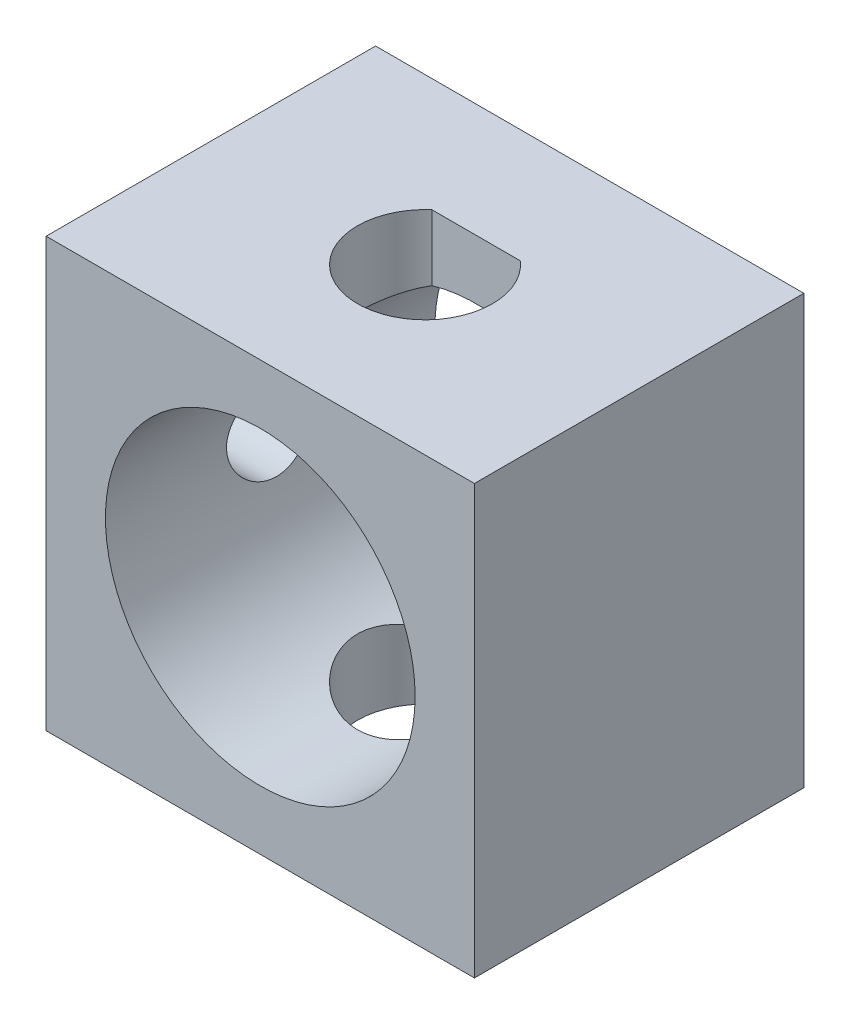
ISO-10303-21;
HEADER;
FILE_DESCRIPTION(('STEP AP214'),'2;1');
FILE_NAME('part.step','',(''),(''),'','','');
FILE_SCHEMA(('AUTOMOTIVE_DESIGN { 1 0 10303 214 1 1 1 1 }'));
ENDSEC;
DATA;
#1=APPLICATION_CONTEXT('core data for automotive mechanical design processes');
#2=APPLICATION_PROTOCOL_DEFINITION('international standard','automotive_design',2000,#1);
#3=PRODUCT_CONTEXT('',#1,'mechanical');
#4=PRODUCT('Part','Part','',(#3));
#5=PRODUCT_RELATED_PRODUCT_CATEGORY('part','',(#4));
#6=PRODUCT_DEFINITION_FORMATION('','',#4);
#7=PRODUCT_DEFINITION_CONTEXT('part definition',#1,'design');
#8=PRODUCT_DEFINITION('design','',#6,#7);
#9=PRODUCT_DEFINITION_SHAPE('','',#8);
#10=(LENGTH_UNIT() NAMED_UNIT(*) SI_UNIT(.MILLI.,.METRE.));
#11=(NAMED_UNIT(*) PLANE_ANGLE_UNIT() SI_UNIT($,.RADIAN.));
#12=(NAMED_UNIT(*) SI_UNIT($,.STERADIAN.) SOLID_ANGLE_UNIT());
#13=UNCERTAINTY_MEASURE_WITH_UNIT(LENGTH_MEASURE(1.E-05),#10,'distance_accuracy_value','');
#14=(GEOMETRIC_REPRESENTATION_CONTEXT(3) GLOBAL_UNCERTAINTY_ASSIGNED_CONTEXT((#13)) GLOBAL_UNIT_ASSIGNED_CONTEXT((#10,
#11,#12)) REPRESENTATION_CONTEXT('',''));
#15=CARTESIAN_POINT('',(0.,0.,0.));
#16=DIRECTION('',(0.,0.,1.));
#17=DIRECTION('',(1.,0.,0.));
#18=AXIS2_PLACEMENT_3D('',#15,#16,#17);
#19=CARTESIAN_POINT('',(0.,13.,0.));
#20=DIRECTION('',(0.,-1.,0.));
#21=DIRECTION('',(0.,0.,-1.));
#22=AXIS2_PLACEMENT_3D('',#19,#20,#21);
#23=CYLINDRICAL_SURFACE('',#22,2.05);
#24=CARTESIAN_POINT('',(-1.34164078649987,11.0044422518221,-1.55));
#25=CARTESIAN_POINT('',(-1.42898328747732,10.9784479280636,-1.47443144523154));
#26=CARTESIAN_POINT('',(-1.50978083940855,10.9515917293722,-1.39155300073304));
#27=CARTESIAN_POINT('',(-1.65675896152417,10.8990029114385,-1.21287125206794));
#28=CARTESIAN_POINT('',(-1.72288466812119,10.8732747888335,-1.11702152387154));
#29=CARTESIAN_POINT('',(-1.83842711865774,10.8259814128771,-0.914494756291968));
#30=CARTESIAN_POINT('',(-1.88781341886009,10.8044237745592,-0.807798443456865));
#31=CARTESIAN_POINT('',(-1.96778355458597,10.7684620812722,-0.586608998289916));
#32=CARTESIAN_POINT('',(-1.99840447368555,10.754043928371,-0.472131743294049));
#33=CARTESIAN_POINT('',(-2.03825145553566,10.7350908871173,-0.245823182019748));
#34=CARTESIAN_POINT('',(-2.04865004819146,10.7300153343702,-0.134244657605172));
#35=CARTESIAN_POINT('',(-2.05110233089124,10.7288279926263,0.089184369782629));
#36=CARTESIAN_POINT('',(-2.04315518235607,10.7327166133795,0.201034884955032));
#37=CARTESIAN_POINT('',(-2.01047247270045,10.7483273879697,0.413909395042074));
#38=CARTESIAN_POINT('',(-1.98689874871863,10.7595066125937,0.515156357183491));
#39=CARTESIAN_POINT('',(-1.92509018187594,10.7877936986579,0.712175142011393));
#40=CARTESIAN_POINT('',(-1.8868528816692,10.8049025537488,0.807946043918026));
#41=CARTESIAN_POINT('',(-1.7946227467996,10.8441865494698,0.9967047928991));
#42=CARTESIAN_POINT('',(-1.73992817252654,10.8665749154685,1.0893040734962));
#43=CARTESIAN_POINT('',(-1.61709056263705,10.9135404145329,1.26450671364645));
#44=CARTESIAN_POINT('',(-1.54894089648929,10.9381186234408,1.34710511236183));
#45=CARTESIAN_POINT('',(-1.39399616146739,10.989320402735,1.5075770807813));
#46=CARTESIAN_POINT('',(-1.30608267886169,11.0159317585712,1.58437948793877));
#47=CARTESIAN_POINT('',(-1.11792183122583,11.0661496182162,1.72231102295533));
#48=CARTESIAN_POINT('',(-1.01767379634572,11.0897559586905,1.78343929904622));
#49=CARTESIAN_POINT('',(-0.807266300325445,11.131393300179,1.88801731257545));
#50=CARTESIAN_POINT('',(-0.697110070151457,11.1494261102192,1.93147278760401));
#51=CARTESIAN_POINT('',(-0.47006168968736,11.1778301922612,1.99888471674901));
#52=CARTESIAN_POINT('',(-0.353174038683742,11.1882065192332,2.02285403709769));
#53=CARTESIAN_POINT('',(-0.125667380471896,11.1995935999687,2.04909795591975));
#54=CARTESIAN_POINT('',(-0.0152554197314319,11.2012617931991,2.05289586164177));
#55=CARTESIAN_POINT('',(0.204576413448678,11.1968315008766,2.04273077702396));
#56=CARTESIAN_POINT('',(0.313996453426419,11.190734352489,2.02877084452347));
#57=CARTESIAN_POINT('',(0.524628670788285,11.1717825109479,1.98454738030595));
#58=CARTESIAN_POINT('',(0.625994671252451,11.1591829583877,1.95489841141171));
#59=CARTESIAN_POINT('',(0.822273892123968,11.1285787834307,1.88079164004508));
#60=CARTESIAN_POINT('',(0.917185915305914,11.1105731615342,1.8363310989718));
#61=CARTESIAN_POINT('',(1.10308829085105,11.0697598493753,1.73137398183267));
#62=CARTESIAN_POINT('',(1.19364452565858,11.0467569011544,1.67018610427979));
#63=CARTESIAN_POINT('',(1.36362892625445,10.9987034246651,1.53455296519663));
#64=CARTESIAN_POINT('',(1.44305131427402,10.9736518438828,1.46010086553933));
#65=CARTESIAN_POINT('',(1.59462936897998,10.9219948039606,1.2935440790499));
#66=CARTESIAN_POINT('',(1.66580756787925,10.8954120863228,1.20053912830956));
#67=CARTESIAN_POINT('',(1.79164500595977,10.8456417236287,1.00309915869953));
#68=CARTESIAN_POINT('',(1.84630423821721,10.8224540799955,0.898664135039021));
#69=CARTESIAN_POINT('',(1.93689402682008,10.7826264404475,0.68165601608533));
#70=CARTESIAN_POINT('',(1.97295807709315,10.7659399906292,0.569147725629479));
#71=CARTESIAN_POINT('',(2.02526368030897,10.7413640904643,0.33871946162273));
#72=CARTESIAN_POINT('',(2.04152321098617,10.7334666623656,0.220804497095198));
#73=CARTESIAN_POINT('',(2.05282518554347,10.7279938556961,-0.00533182931242675));
#74=CARTESIAN_POINT('',(2.04968582130129,10.7295338234827,-0.113444435365322));
#75=CARTESIAN_POINT('',(2.02654448529654,10.7406696267466,-0.327403030429603));
#76=CARTESIAN_POINT('',(2.00654423886749,10.7502646379703,-0.433249250218545));
#77=CARTESIAN_POINT('',(1.95134287800153,10.7758793467128,-0.636861702836273));
#78=CARTESIAN_POINT('',(1.9165738059491,10.7917155811279,-0.734769935275487));
#79=CARTESIAN_POINT('',(1.83308089572466,10.8280343930724,-0.92356948429417));
#80=CARTESIAN_POINT('',(1.7843466149331,10.8485204451554,-1.01445548512165));
#81=CARTESIAN_POINT('',(1.67578968049566,10.8914715802613,-1.18496839018981));
#82=CARTESIAN_POINT('',(1.61632632864714,10.9138627810599,-1.26484396999386));
#83=CARTESIAN_POINT('',(1.48671495591251,10.9591938902215,-1.41491997262162));
#84=CARTESIAN_POINT('',(1.41658922563374,10.9821325715942,-1.48514001112307));
#85=CARTESIAN_POINT('',(1.34164078649987,11.0044422518221,-1.55));
#86=B_SPLINE_CURVE_WITH_KNOTS('',3,(#24,#25,#26,#27,#28,#29,#30,#31,#32,#33,#34,#35,#36,#37,#38,
#39,#40,#41,#42,#43,#44,#45,#46,#47,#48,#49,#50,#51,#52,#53,#54,#55,#56,#57,#58,#59,#60,#61,#62,
#63,#64,#65,#66,#67,#68,#69,#70,#71,#72,#73,#74,#75,#76,#77,#78,#79,#80,#81,#82,#83,#84,#85),
.UNSPECIFIED.,.F.,.F.,(4,2,2,2,2,2,2,2,2,2,2,2,2,2,2,2,2,2,2,2,2,2,2,2,2,2,2,2,2,2,4),(0.,
0.354814455133978,0.710934135339442,1.06769805345763,1.42375465272712,1.75846646391984,
2.09319357500706,2.40546887072054,2.71779652091909,3.04599134101445,3.3743482976541,
3.73186797404073,4.08940707475052,4.44683000521503,4.80401674593097,5.13380070258176,
5.46352787924357,5.7812032009427,6.09893729217702,6.43257594116155,6.76638709180485,
7.12498465098841,7.48358236047531,7.83956855840411,8.19523136518087,8.51809823207263,
8.84093206478415,9.15490988621499,9.46912310299146,9.77429750660691,10.0788424733305),.UNSPECIFIED.);
#87=CARTESIAN_POINT('',(-1.34164078649987,11.0044422518221,-1.55));
#88=VERTEX_POINT('',#87);
#89=CARTESIAN_POINT('',(1.34164078649987,11.0044422518221,-1.55));
#90=VERTEX_POINT('',#89);
#91=EDGE_CURVE('E63',#88,#90,#86,.T.);
#92=ORIENTED_EDGE('',*,*,#91,.F.);
#93=DIRECTION('',(0.,-1.,0.));
#94=VECTOR('',#93,1.);
#95=CARTESIAN_POINT('',(-1.34164078649987,13.,-1.55));
#96=LINE('',#95,#94);
#97=CARTESIAN_POINT('',(-1.34164078649987,13.,-1.55));
#98=VERTEX_POINT('',#97);
#99=EDGE_CURVE('E134',#98,#88,#96,.T.);
#100=ORIENTED_EDGE('',*,*,#99,.F.);
#101=CARTESIAN_POINT('',(0.,13.,0.));
#102=DIRECTION('',(0.,1.,0.));
#103=DIRECTION('',(0.,0.,1.));
#104=AXIS2_PLACEMENT_3D('',#101,#102,#103);
#105=CIRCLE('',#104,2.05);
#106=CARTESIAN_POINT('',(1.34164078649987,13.,-1.55));
#107=VERTEX_POINT('',#106);
#108=EDGE_CURVE('E171',#98,#107,#105,.T.);
#109=ORIENTED_EDGE('',*,*,#108,.T.);
#110=DIRECTION('',(0.,-1.,0.));
#111=VECTOR('',#110,1.);
#112=CARTESIAN_POINT('',(1.34164078649987,13.,-1.55));
#113=LINE('',#112,#111);
#114=EDGE_CURVE('E123',#107,#90,#113,.T.);
#115=ORIENTED_EDGE('',*,*,#114,.T.);
#116=EDGE_LOOP('',(#92,#100,#109,#115));
#117=FACE_BOUND('',#116,.T.);
#118=ADVANCED_FACE('F40',(#117),#23,.F.);
#119=CARTESIAN_POINT('',(0.,13.,-1.55));
#120=DIRECTION('',(0.,0.,-1.));
#121=DIRECTION('',(-1.,0.,0.));
#122=AXIS2_PLACEMENT_3D('',#119,#120,#121);
#123=PLANE('',#122);
#124=ORIENTED_EDGE('',*,*,#99,.T.);
#125=CARTESIAN_POINT('',(0.,6.5,-1.55));
#126=DIRECTION('',(0.,0.,-1.));
#127=DIRECTION('',(-1.,0.,0.));
#128=AXIS2_PLACEMENT_3D('',#125,#126,#127);
#129=CIRCLE('',#128,4.7);
#130=EDGE_CURVE('E11',#88,#90,#129,.T.);
#131=ORIENTED_EDGE('',*,*,#130,.T.);
#132=ORIENTED_EDGE('',*,*,#114,.F.);
#133=DIRECTION('',(1.,0.,0.));
#134=VECTOR('',#133,1.);
#135=CARTESIAN_POINT('',(0.,13.,-1.55));
#136=LINE('',#135,#134);
#137=EDGE_CURVE('E216',#98,#107,#136,.T.);
#138=ORIENTED_EDGE('',*,*,#137,.F.);
#139=EDGE_LOOP('',(#124,#131,#132,#138));
#140=FACE_BOUND('',#139,.T.);
#141=ADVANCED_FACE('F208',(#140),#123,.F.);
#142=CARTESIAN_POINT('',(0.,13.,5.));
#143=DIRECTION('',(0.,0.,-1.));
#144=DIRECTION('',(-1.,0.,0.));
#145=AXIS2_PLACEMENT_3D('',#142,#143,#144);
#146=PLANE('',#145);
#147=CARTESIAN_POINT('',(0.,6.5,5.));
#148=DIRECTION('',(0.,0.,1.));
#149=DIRECTION('',(1.,0.,0.));
#150=AXIS2_PLACEMENT_3D('',#147,#148,#149);
#151=CIRCLE('',#150,4.7);
#152=CARTESIAN_POINT('',(4.7,6.5,5.));
#153=VERTEX_POINT('',#152);
#154=EDGE_CURVE('E270',#153,#153,#151,.T.);
#155=ORIENTED_EDGE('',*,*,#154,.F.);
#156=EDGE_LOOP('',(#155));
#157=FACE_BOUND('',#156,.T.);
#158=DIRECTION('',(1.,0.,0.));
#159=VECTOR('',#158,1.);
#160=CARTESIAN_POINT('',(0.,0.,5.));
#161=LINE('',#160,#159);
#162=CARTESIAN_POINT('',(-6.5,0.,5.));
#163=VERTEX_POINT('',#162);
#164=CARTESIAN_POINT('',(6.5,0.,5.));
#165=VERTEX_POINT('',#164);
#166=EDGE_CURVE('E149',#163,#165,#161,.T.);
#167=ORIENTED_EDGE('',*,*,#166,.T.);
#168=DIRECTION('',(0.,-1.,0.));
#169=VECTOR('',#168,1.);
#170=CARTESIAN_POINT('',(6.5,13.,5.));
#171=LINE('',#170,#169);
#172=CARTESIAN_POINT('',(6.5,13.,5.));
#173=VERTEX_POINT('',#172);
#174=EDGE_CURVE('E109',#173,#165,#171,.T.);
#175=ORIENTED_EDGE('',*,*,#174,.F.);
#176=DIRECTION('',(1.,0.,0.));
#177=VECTOR('',#176,1.);
#178=CARTESIAN_POINT('',(0.,13.,5.));
#179=LINE('',#178,#177);
#180=CARTESIAN_POINT('',(-6.5,13.,5.));
#181=VERTEX_POINT('',#180);
#182=EDGE_CURVE('E251',#181,#173,#179,.T.);
#183=ORIENTED_EDGE('',*,*,#182,.F.);
#184=DIRECTION('',(0.,-1.,0.));
#185=VECTOR('',#184,1.);
#186=CARTESIAN_POINT('',(-6.5,13.,5.));
#187=LINE('',#186,#185);
#188=EDGE_CURVE('E137',#181,#163,#187,.T.);
#189=ORIENTED_EDGE('',*,*,#188,.T.);
#190=EDGE_LOOP('',(#167,#175,#183,#189));
#191=FACE_BOUND('',#190,.T.);
#192=ADVANCED_FACE('F190',(#157,#191),#146,.F.);
#193=CARTESIAN_POINT('',(6.5,13.,0.));
#194=DIRECTION('',(-1.,0.,0.));
#195=DIRECTION('',(0.,0.,1.));
#196=AXIS2_PLACEMENT_3D('',#193,#194,#195);
#197=PLANE('',#196);
#198=DIRECTION('',(0.,0.,-1.));
#199=VECTOR('',#198,1.);
#200=CARTESIAN_POINT('',(6.5,0.,0.));
#201=LINE('',#200,#199);
#202=CARTESIAN_POINT('',(6.5,0.,-5.));
#203=VERTEX_POINT('',#202);
#204=EDGE_CURVE('E160',#165,#203,#201,.T.);
#205=ORIENTED_EDGE('',*,*,#204,.T.);
#206=DIRECTION('',(0.,-1.,0.));
#207=VECTOR('',#206,1.);
#208=CARTESIAN_POINT('',(6.5,13.,-5.));
#209=LINE('',#208,#207);
#210=CARTESIAN_POINT('',(6.5,13.,-5.));
#211=VERTEX_POINT('',#210);
#212=EDGE_CURVE('E174',#211,#203,#209,.T.);
#213=ORIENTED_EDGE('',*,*,#212,.F.);
#214=DIRECTION('',(0.,0.,-1.));
#215=VECTOR('',#214,1.);
#216=CARTESIAN_POINT('',(6.5,13.,0.));
#217=LINE('',#216,#215);
#218=EDGE_CURVE('E185',#173,#211,#217,.T.);
#219=ORIENTED_EDGE('',*,*,#218,.F.);
#220=ORIENTED_EDGE('',*,*,#174,.T.);
#221=EDGE_LOOP('',(#205,#213,#219,#220));
#222=FACE_BOUND('',#221,.T.);
#223=ADVANCED_FACE('F184',(#222),#197,.F.);
#224=CARTESIAN_POINT('',(0.,13.,-5.));
#225=DIRECTION('',(0.,0.,-1.));
#226=DIRECTION('',(-1.,0.,0.));
#227=AXIS2_PLACEMENT_3D('',#224,#225,#226);
#228=PLANE('',#227);
#229=CARTESIAN_POINT('',(0.,6.5,-5.));
#230=DIRECTION('',(0.,0.,1.));
#231=DIRECTION('',(1.,0.,0.));
#232=AXIS2_PLACEMENT_3D('',#229,#230,#231);
#233=CIRCLE('',#232,4.7);
#234=CARTESIAN_POINT('',(4.7,6.5,-5.));
#235=VERTEX_POINT('',#234);
#236=EDGE_CURVE('E116',#235,#235,#233,.T.);
#237=ORIENTED_EDGE('',*,*,#236,.T.);
#238=EDGE_LOOP('',(#237));
#239=FACE_BOUND('',#238,.T.);
#240=DIRECTION('',(1.,0.,0.));
#241=VECTOR('',#240,1.);
#242=CARTESIAN_POINT('',(0.,0.,-5.));
#243=LINE('',#242,#241);
#244=CARTESIAN_POINT('',(-6.5,0.,-5.));
#245=VERTEX_POINT('',#244);
#246=EDGE_CURVE('E164',#245,#203,#243,.T.);
#247=ORIENTED_EDGE('',*,*,#246,.F.);
#248=DIRECTION('',(0.,-1.,0.));
#249=VECTOR('',#248,1.);
#250=CARTESIAN_POINT('',(-6.5,13.,-5.));
#251=LINE('',#250,#249);
#252=CARTESIAN_POINT('',(-6.5,13.,-5.));
#253=VERTEX_POINT('',#252);
#254=EDGE_CURVE('E142',#253,#245,#251,.T.);
#255=ORIENTED_EDGE('',*,*,#254,.F.);
#256=DIRECTION('',(1.,0.,0.));
#257=VECTOR('',#256,1.);
#258=CARTESIAN_POINT('',(0.,13.,-5.));
#259=LINE('',#258,#257);
#260=EDGE_CURVE('E130',#253,#211,#259,.T.);
#261=ORIENTED_EDGE('',*,*,#260,.T.);
#262=ORIENTED_EDGE('',*,*,#212,.T.);
#263=EDGE_LOOP('',(#247,#255,#261,#262));
#264=FACE_BOUND('',#263,.T.);
#265=ADVANCED_FACE('F196',(#239,#264),#228,.T.);
#266=CARTESIAN_POINT('',(1.34164078649987,1.99555774817791,-1.55));
#267=CARTESIAN_POINT('',(1.42898328747731,2.02155207193642,-1.47443144523154));
#268=CARTESIAN_POINT('',(1.50978083940854,2.04840827062777,-1.39155300073305));
#269=CARTESIAN_POINT('',(1.65675896152417,2.10099708856146,-1.21287125206794));
#270=CARTESIAN_POINT('',(1.72288466812119,2.12672521116653,-1.11702152387154));
#271=CARTESIAN_POINT('',(1.83842711865774,2.17401858712288,-0.914494756291971));
#272=CARTESIAN_POINT('',(1.88781341886009,2.1955762254408,-0.807798443456869));
#273=CARTESIAN_POINT('',(1.96778355458597,2.23153791872784,-0.586608998289919));
#274=CARTESIAN_POINT('',(1.99840447368555,2.24595607162897,-0.472131743294053));
#275=CARTESIAN_POINT('',(2.03825145553566,2.26490911288269,-0.245823182019752));
#276=CARTESIAN_POINT('',(2.04865004819145,2.26998466562981,-0.134244657605176));
#277=CARTESIAN_POINT('',(2.05110233089124,2.27117200737372,0.0891843697826246));
#278=CARTESIAN_POINT('',(2.04315518235607,2.26728338662045,0.201034884955027));
#279=CARTESIAN_POINT('',(2.01047247270045,2.25167261203034,0.41390939504207));
#280=CARTESIAN_POINT('',(1.98689874871863,2.24049338740631,0.515156357183486));
#281=CARTESIAN_POINT('',(1.92509018187594,2.21220630134214,0.712175142011388));
#282=CARTESIAN_POINT('',(1.8868528816692,2.1950974462512,0.807946043918022));
#283=CARTESIAN_POINT('',(1.7946227467996,2.15581345053023,0.996704792899096));
#284=CARTESIAN_POINT('',(1.73992817252654,2.13342508453153,1.0893040734962));
#285=CARTESIAN_POINT('',(1.61709056263705,2.08645958546711,1.26450671364644));
#286=CARTESIAN_POINT('',(1.54894089648929,2.06188137655921,1.34710511236183));
#287=CARTESIAN_POINT('',(1.3939961614674,2.01067959726502,1.5075770807813));
#288=CARTESIAN_POINT('',(1.30608267886169,1.98406824142879,1.58437948793877));
#289=CARTESIAN_POINT('',(1.11792183122584,1.93385038178377,1.72231102295533));
#290=CARTESIAN_POINT('',(1.01767379634573,1.91024404130948,1.78343929904622));
#291=CARTESIAN_POINT('',(0.807266300325451,1.86860669982098,1.88801731257544));
#292=CARTESIAN_POINT('',(0.697110070151464,1.85057388978079,1.931472787604));
#293=CARTESIAN_POINT('',(0.470061689687366,1.82216980773878,1.998884716749));
#294=CARTESIAN_POINT('',(0.353174038683748,1.81179348076684,2.02285403709769));
#295=CARTESIAN_POINT('',(0.125667380471902,1.80040640003127,2.04909795591975));
#296=CARTESIAN_POINT('',(0.0152554197314381,1.79873820680091,2.05289586164176));
#297=CARTESIAN_POINT('',(-0.204576413448672,1.80316849912338,2.04273077702396));
#298=CARTESIAN_POINT('',(-0.313996453426413,1.80926564751103,2.02877084452347));
#299=CARTESIAN_POINT('',(-0.52462867078828,1.82821748905206,1.98454738030595));
#300=CARTESIAN_POINT('',(-0.625994671252446,1.84081704161234,1.95489841141171));
#301=CARTESIAN_POINT('',(-0.822273892123963,1.87142121656926,1.88079164004508));
#302=CARTESIAN_POINT('',(-0.917185915305909,1.88942683846582,1.83633109897181));
#303=CARTESIAN_POINT('',(-1.10308829085104,1.9302401506247,1.73137398183267));
#304=CARTESIAN_POINT('',(-1.19364452565858,1.95324309884562,1.67018610427979));
#305=CARTESIAN_POINT('',(-1.36362892625445,2.00129657533488,1.53455296519663));
#306=CARTESIAN_POINT('',(-1.44305131427402,2.02634815611722,1.46010086553934));
#307=CARTESIAN_POINT('',(-1.59462936897997,2.07800519603936,1.2935440790499));
#308=CARTESIAN_POINT('',(-1.66580756787924,2.10458791367721,1.20053912830956));
#309=CARTESIAN_POINT('',(-1.79164500595976,2.15435827637127,1.00309915869953));
#310=CARTESIAN_POINT('',(-1.84630423821721,2.17754592000445,0.898664135039026));
#311=CARTESIAN_POINT('',(-1.93689402682008,2.21737355955249,0.681656016085334));
#312=CARTESIAN_POINT('',(-1.97295807709315,2.23406000937076,0.569147725629483));
#313=CARTESIAN_POINT('',(-2.02526368030897,2.25863590953565,0.338719461622735));
#314=CARTESIAN_POINT('',(-2.04152321098617,2.26653333763438,0.220804497095202));
#315=CARTESIAN_POINT('',(-2.05282518554347,2.27200614430393,-0.00533182931242245));
#316=CARTESIAN_POINT('',(-2.04968582130129,2.2704661765173,-0.113444435365318));
#317=CARTESIAN_POINT('',(-2.02654448529654,2.25933037325335,-0.327403030429599));
#318=CARTESIAN_POINT('',(-2.00654423886749,2.24973536202968,-0.43324925021854));
#319=CARTESIAN_POINT('',(-1.95134287800153,2.22412065328715,-0.636861702836268));
#320=CARTESIAN_POINT('',(-1.9165738059491,2.20828441887208,-0.734769935275483));
#321=CARTESIAN_POINT('',(-1.83308089572466,2.17196560692756,-0.923569484294166));
#322=CARTESIAN_POINT('',(-1.78434661493311,2.15147955484456,-1.01445548512164));
#323=CARTESIAN_POINT('',(-1.67578968049566,2.1085284197387,-1.18496839018981));
#324=CARTESIAN_POINT('',(-1.61632632864714,2.08613721894006,-1.26484396999386));
#325=CARTESIAN_POINT('',(-1.48671495591251,2.04080610977845,-1.41491997262162));
#326=CARTESIAN_POINT('',(-1.41658922563374,2.01786742840576,-1.48514001112307));
#327=CARTESIAN_POINT('',(-1.34164078649987,1.99555774817792,-1.55));
#328=B_SPLINE_CURVE_WITH_KNOTS('',3,(#266,#267,#268,#269,#270,#271,#272,#273,#274,#275,#276,
#277,#278,#279,#280,#281,#282,#283,#284,#285,#286,#287,#288,#289,#290,#291,#292,#293,#294,#295,
#296,#297,#298,#299,#300,#301,#302,#303,#304,#305,#306,#307,#308,#309,#310,#311,#312,#313,#314,
#315,#316,#317,#318,#319,#320,#321,#322,#323,#324,#325,#326,#327),.UNSPECIFIED.,.F.,.F.,(4,2,2,
2,2,2,2,2,2,2,2,2,2,2,2,2,2,2,2,2,2,2,2,2,2,2,2,2,2,2,4),(0.,0.354814455133978,
0.710934135339442,1.06769805345763,1.42375465272712,1.75846646391984,2.09319357500706,
2.40546887072054,2.71779652091909,3.04599134101445,3.37434829765409,3.73186797404072,
4.08940707475051,4.44683000521503,4.80401674593097,5.13380070258175,5.46352787924357,
5.78120320094269,6.09893729217702,6.43257594116155,6.76638709180485,7.12498465098841,
7.48358236047531,7.83956855840411,8.19523136518087,8.51809823207263,8.84093206478415,
9.15490988621499,9.46912310299146,9.77429750660691,10.0788424733305),.UNSPECIFIED.);
#329=CARTESIAN_POINT('',(1.34164078649987,1.99555774817792,-1.55));
#330=VERTEX_POINT('',#329);
#331=CARTESIAN_POINT('',(-1.34164078649987,1.99555774817792,-1.55));
#332=VERTEX_POINT('',#331);
#333=EDGE_CURVE('E56',#330,#332,#328,.T.);
#334=ORIENTED_EDGE('',*,*,#333,.F.);
#335=CARTESIAN_POINT('',(1.34164078649987,0.,-1.55));
#336=VERTEX_POINT('',#335);
#337=EDGE_CURVE('E112',#330,#336,#113,.T.);
#338=ORIENTED_EDGE('',*,*,#337,.T.);
#339=CARTESIAN_POINT('',(0.,0.,0.));
#340=DIRECTION('',(0.,1.,0.));
#341=DIRECTION('',(0.,0.,1.));
#342=AXIS2_PLACEMENT_3D('',#339,#340,#341);
#343=CIRCLE('',#342,2.05);
#344=CARTESIAN_POINT('',(-1.34164078649987,0.,-1.55));
#345=VERTEX_POINT('',#344);
#346=EDGE_CURVE('E147',#345,#336,#343,.T.);
#347=ORIENTED_EDGE('',*,*,#346,.F.);
#348=EDGE_CURVE('E114',#332,#345,#96,.T.);
#349=ORIENTED_EDGE('',*,*,#348,.F.);
#350=EDGE_LOOP('',(#334,#338,#347,#349));
#351=FACE_BOUND('',#350,.T.);
#352=ADVANCED_FACE('F42',(#351),#23,.F.);
#353=ORIENTED_EDGE('',*,*,#337,.F.);
#354=EDGE_CURVE('E45',#330,#332,#129,.T.);
#355=ORIENTED_EDGE('',*,*,#354,.T.);
#356=ORIENTED_EDGE('',*,*,#348,.T.);
#357=DIRECTION('',(1.,0.,0.));
#358=VECTOR('',#357,1.);
#359=CARTESIAN_POINT('',(0.,0.,-1.55));
#360=LINE('',#359,#358);
#361=EDGE_CURVE('E120',#345,#336,#360,.T.);
#362=ORIENTED_EDGE('',*,*,#361,.T.);
#363=EDGE_LOOP('',(#353,#355,#356,#362));
#364=FACE_BOUND('',#363,.T.);
#365=ADVANCED_FACE('F118',(#364),#123,.F.);
#366=CARTESIAN_POINT('',(-6.5,13.,0.));
#367=DIRECTION('',(-1.,0.,0.));
#368=DIRECTION('',(0.,0.,1.));
#369=AXIS2_PLACEMENT_3D('',#366,#367,#368);
#370=PLANE('',#369);
#371=CARTESIAN_POINT('',(-6.5,6.5,0.));
#372=DIRECTION('',(-1.,0.,0.));
#373=DIRECTION('',(0.,0.,1.));
#374=AXIS2_PLACEMENT_3D('',#371,#372,#373);
#375=CIRCLE('',#374,1.325);
#376=CARTESIAN_POINT('',(-6.5,6.5,1.325));
#377=VERTEX_POINT('',#376);
#378=EDGE_CURVE('E268',#377,#377,#375,.T.);
#379=ORIENTED_EDGE('',*,*,#378,.F.);
#380=EDGE_LOOP('',(#379));
#381=FACE_BOUND('',#380,.T.);
#382=DIRECTION('',(0.,0.,-1.));
#383=VECTOR('',#382,1.);
#384=CARTESIAN_POINT('',(-6.5,0.,0.));
#385=LINE('',#384,#383);
#386=EDGE_CURVE('E168',#163,#245,#385,.T.);
#387=ORIENTED_EDGE('',*,*,#386,.F.);
#388=ORIENTED_EDGE('',*,*,#188,.F.);
#389=DIRECTION('',(0.,0.,-1.));
#390=VECTOR('',#389,1.);
#391=CARTESIAN_POINT('',(-6.5,13.,0.));
#392=LINE('',#391,#390);
#393=EDGE_CURVE('E124',#181,#253,#392,.T.);
#394=ORIENTED_EDGE('',*,*,#393,.T.);
#395=ORIENTED_EDGE('',*,*,#254,.T.);
#396=EDGE_LOOP('',(#387,#388,#394,#395));
#397=FACE_BOUND('',#396,.T.);
#398=ADVANCED_FACE('F193',(#381,#397),#370,.T.);
#399=CARTESIAN_POINT('',(0.,13.,0.));
#400=DIRECTION('',(0.,1.,0.));
#401=DIRECTION('',(0.,0.,1.));
#402=AXIS2_PLACEMENT_3D('',#399,#400,#401);
#403=PLANE('',#402);
#404=ORIENTED_EDGE('',*,*,#108,.F.);
#405=ORIENTED_EDGE('',*,*,#137,.T.);
#406=EDGE_LOOP('',(#404,#405));
#407=FACE_BOUND('',#406,.T.);
#408=ORIENTED_EDGE('',*,*,#182,.T.);
#409=ORIENTED_EDGE('',*,*,#218,.T.);
#410=ORIENTED_EDGE('',*,*,#260,.F.);
#411=ORIENTED_EDGE('',*,*,#393,.F.);
#412=EDGE_LOOP('',(#408,#409,#410,#411));
#413=FACE_BOUND('',#412,.T.);
#414=ADVANCED_FACE('F229',(#407,#413),#403,.T.);
#415=CARTESIAN_POINT('',(0.,0.,0.));
#416=DIRECTION('',(0.,1.,0.));
#417=DIRECTION('',(0.,0.,1.));
#418=AXIS2_PLACEMENT_3D('',#415,#416,#417);
#419=PLANE('',#418);
#420=ORIENTED_EDGE('',*,*,#346,.T.);
#421=ORIENTED_EDGE('',*,*,#361,.F.);
#422=EDGE_LOOP('',(#420,#421));
#423=FACE_BOUND('',#422,.T.);
#424=ORIENTED_EDGE('',*,*,#166,.F.);
#425=ORIENTED_EDGE('',*,*,#386,.T.);
#426=ORIENTED_EDGE('',*,*,#246,.T.);
#427=ORIENTED_EDGE('',*,*,#204,.F.);
#428=EDGE_LOOP('',(#424,#425,#426,#427));
#429=FACE_BOUND('',#428,.T.);
#430=ADVANCED_FACE('F145',(#423,#429),#419,.F.);
#431=CARTESIAN_POINT('',(0.,6.5,-5.));
#432=DIRECTION('',(0.,0.,1.));
#433=DIRECTION('',(1.,0.,0.));
#434=AXIS2_PLACEMENT_3D('',#431,#432,#433);
#435=CYLINDRICAL_SURFACE('',#434,4.7);
#436=CARTESIAN_POINT('',(-4.7,6.5,1.325));
#437=CARTESIAN_POINT('',(-4.69999907976401,6.42711430378187,1.3249986177954));
#438=CARTESIAN_POINT('',(-4.69828810042033,6.35421429153462,1.31896597318192));
#439=CARTESIAN_POINT('',(-4.69162924361478,6.21052454684652,1.29504392052571));
#440=CARTESIAN_POINT('',(-4.68668007358049,6.1397356688994,1.27714977775057));
#441=CARTESIAN_POINT('',(-4.67408934448237,6.00236229638731,1.23014041428014));
#442=CARTESIAN_POINT('',(-4.66645148328648,5.93577217467204,1.20104060007161));
#443=CARTESIAN_POINT('',(-4.64928459475338,5.80841680222769,1.1325057728815));
#444=CARTESIAN_POINT('',(-4.63975538391295,5.74765211754533,1.09306975693808));
#445=CARTESIAN_POINT('',(-4.61955571311399,5.63211333764317,1.00391445487797));
#446=CARTESIAN_POINT('',(-4.60886398268846,5.57750995550685,0.953978759257469));
#447=CARTESIAN_POINT('',(-4.58767647873074,5.47733104231579,0.845703561755449));
#448=CARTESIAN_POINT('',(-4.5771807338971,5.43175682417365,0.78736283984303));
#449=CARTESIAN_POINT('',(-4.55735276272415,5.3500685485122,0.662534854340441));
#450=CARTESIAN_POINT('',(-4.54804719932532,5.31415617456513,0.595910979511576));
#451=CARTESIAN_POINT('',(-4.53196826763456,5.25411211198994,0.457265584556224));
#452=CARTESIAN_POINT('',(-4.52519437079195,5.22997796403124,0.38524519486495));
#453=CARTESIAN_POINT('',(-4.51516626228814,5.19477842217477,0.239753958751116));
#454=CARTESIAN_POINT('',(-4.51182822476169,5.18340114185074,0.166364493593896));
#455=CARTESIAN_POINT('',(-4.50879979245648,5.17306519822211,0.0186484515107056));
#456=CARTESIAN_POINT('',(-4.50910862816821,5.17410391507707,-0.0556779244158441));
#457=CARTESIAN_POINT('',(-4.5132643470869,5.1883240519656,-0.200679326320357));
#458=CARTESIAN_POINT('',(-4.51699957586025,5.20112229108024,-0.271395648549183));
#459=CARTESIAN_POINT('',(-4.52740761287723,5.23788207925271,-0.409634002102872));
#460=CARTESIAN_POINT('',(-4.53408068039607,5.26184461361209,-0.477155750912118));
#461=CARTESIAN_POINT('',(-4.54970661059836,5.3205515174392,-0.608059591240924));
#462=CARTESIAN_POINT('',(-4.55868667863675,5.35542571382502,-0.671380073484859));
#463=CARTESIAN_POINT('',(-4.57790085106482,5.43487559371667,-0.791402100855855));
#464=CARTESIAN_POINT('',(-4.58813522790222,5.4794533865731,-0.848102202732602));
#465=CARTESIAN_POINT('',(-4.60916436030629,5.57897940515098,-0.955456397630536));
#466=CARTESIAN_POINT('',(-4.6199659080834,5.63424777785388,-1.00581281752329));
#467=CARTESIAN_POINT('',(-4.64057780991576,5.75257831735314,-1.09660720542707));
#468=CARTESIAN_POINT('',(-4.65038811525217,5.81564086688929,-1.13704468606876));
#469=CARTESIAN_POINT('',(-4.66798480068998,5.94826598871099,-1.20700605510837));
#470=CARTESIAN_POINT('',(-4.67576012790515,6.01786137806509,-1.23647069635099));
#471=CARTESIAN_POINT('',(-4.68833111207724,6.16128829795701,-1.28319292152508));
#472=CARTESIAN_POINT('',(-4.69312749948692,6.23511878517094,-1.30045349810548));
#473=CARTESIAN_POINT('',(-4.69908745023549,6.3823841254807,-1.32179778282542));
#474=CARTESIAN_POINT('',(-4.70036238966762,6.4557559879825,-1.32628561103916));
#475=CARTESIAN_POINT('',(-4.69945890735427,6.60220593453881,-1.32308042932517));
#476=CARTESIAN_POINT('',(-4.69728088809972,6.67528405183804,-1.31538883908019));
#477=CARTESIAN_POINT('',(-4.68978862586993,6.81759291547765,-1.28837271949334));
#478=CARTESIAN_POINT('',(-4.68453647684975,6.88687093138476,-1.26927836246885));
#479=CARTESIAN_POINT('',(-4.67149646712576,7.02123013838506,-1.22027028085521));
#480=CARTESIAN_POINT('',(-4.66370831660006,7.08631084877859,-1.19035531961147));
#481=CARTESIAN_POINT('',(-4.64620526111286,7.21196150901193,-1.11983757253713));
#482=CARTESIAN_POINT('',(-4.63645294050121,7.27240626754184,-1.07902124408305));
#483=CARTESIAN_POINT('',(-4.61614606528124,7.38572872131768,-0.988123733830395));
#484=CARTESIAN_POINT('',(-4.60559133336117,7.43860473658585,-0.938040500764091));
#485=CARTESIAN_POINT('',(-4.58445132265914,7.53702648932144,-0.828138000125429));
#486=CARTESIAN_POINT('',(-4.57387573415066,7.58228584897222,-0.768059892530577));
#487=CARTESIAN_POINT('',(-4.55425463443073,7.66209290152607,-0.640934083465884));
#488=CARTESIAN_POINT('',(-4.54520906729497,7.69664098597896,-0.573886636879349));
#489=CARTESIAN_POINT('',(-4.52977781312726,7.75379021755066,-0.435017276795329));
#490=CARTESIAN_POINT('',(-4.52337772899894,7.77645621470648,-0.363223740165723));
#491=CARTESIAN_POINT('',(-4.51397419982862,7.80932609262933,-0.216629569924975));
#492=CARTESIAN_POINT('',(-4.51096975937889,7.81953362557277,-0.14182982422341));
#493=CARTESIAN_POINT('',(-4.50878761645041,7.82696916457617,0.00570305253355603));
#494=CARTESIAN_POINT('',(-4.50947338736099,7.82466021844547,0.0784111559149938));
#495=CARTESIAN_POINT('',(-4.5142709126485,7.80821631339446,0.222356475520675));
#496=CARTESIAN_POINT('',(-4.51838255829954,7.79408172978059,0.293593738350991));
#497=CARTESIAN_POINT('',(-4.52948255941749,7.75467030856183,0.43191538958257));
#498=CARTESIAN_POINT('',(-4.53644273284005,7.72950246020098,0.499033255981186));
#499=CARTESIAN_POINT('',(-4.55245345859372,7.66882321078164,0.628146399911769));
#500=CARTESIAN_POINT('',(-4.56150437258644,7.63331001988165,0.690140788649455));
#501=CARTESIAN_POINT('',(-4.58104505000469,7.551590790192,0.809430421427357));
#502=CARTESIAN_POINT('',(-4.5915720887568,7.50507402712249,0.866506713971436));
#503=CARTESIAN_POINT('',(-4.61268338398226,7.40324491640795,0.972193590712421));
#504=CARTESIAN_POINT('',(-4.62326765409591,7.34793037381862,1.0208020559264));
#505=CARTESIAN_POINT('',(-4.64361463806112,7.22842444916245,1.10936430668846));
#506=CARTESIAN_POINT('',(-4.65335052316734,7.16404719555527,1.14907401700486));
#507=CARTESIAN_POINT('',(-4.67059856487958,7.02925637925852,1.21704656005906));
#508=CARTESIAN_POINT('',(-4.67811198011065,6.95884626234037,1.2453158750528));
#509=CARTESIAN_POINT('',(-4.6892350823893,6.8240380893735,1.28642275389505));
#510=CARTESIAN_POINT('',(-4.6932408017525,6.76015422308352,1.30085322010766));
#511=CARTESIAN_POINT('',(-4.69862350799712,6.63085062059186,1.32014186049096));
#512=CARTESIAN_POINT('',(-4.70000082611592,6.56543107897168,1.32500124083521));
#513=CARTESIAN_POINT('',(-4.7,6.5,1.325));
#514=B_SPLINE_CURVE_WITH_KNOTS('',3,(#436,#437,#438,#439,#440,#441,#442,#443,#444,#445,#446,
#447,#448,#449,#450,#451,#452,#453,#454,#455,#456,#457,#458,#459,#460,#461,#462,#463,#464,#465,
#466,#467,#468,#469,#470,#471,#472,#473,#474,#475,#476,#477,#478,#479,#480,#481,#482,#483,#484,
#485,#486,#487,#488,#489,#490,#491,#492,#493,#494,#495,#496,#497,#498,#499,#500,#501,#502,#503,
#504,#505,#506,#507,#508,#509,#510,#511,#512,#513),.UNSPECIFIED.,.T.,.F.,(4,2,2,2,2,2,2,2,2,2,2,
2,2,2,2,2,2,2,2,2,2,2,2,2,2,2,2,2,2,2,2,2,2,2,2,2,2,2,4),(0.,0.218416964593679,
0.436921166829305,0.655126017833116,0.873352049946088,1.09661676724728,1.31991392523376,
1.54756300998897,1.77516454054142,1.99707120858555,2.218931053987,2.43380858214072,
2.64870507783972,2.86626242249575,3.08386710669344,3.3094454252256,3.5350348253804,
3.76182520366037,3.988559949689,4.20803664614105,4.4274877613765,4.64265212680371,
4.85784109049823,5.07760133030988,5.29741027328223,5.52420512448223,5.75099168423644,
5.9765272520804,6.20199668868563,6.41918314512416,6.63636270904784,6.85144363170232,
7.0665617875,7.28868969950709,7.51087311704278,7.73855750624122,7.96611270568271,
8.16221509291517,8.35829276522434),.UNSPECIFIED.);
#515=CARTESIAN_POINT('',(-4.7,6.5,1.325));
#516=VERTEX_POINT('',#515);
#517=EDGE_CURVE('E271',#516,#516,#514,.T.);
#518=ORIENTED_EDGE('',*,*,#517,.F.);
#519=EDGE_LOOP('',(#518));
#520=FACE_BOUND('',#519,.T.);
#521=ORIENTED_EDGE('',*,*,#91,.T.);
#522=ORIENTED_EDGE('',*,*,#130,.F.);
#523=EDGE_LOOP('',(#521,#522));
#524=FACE_BOUND('',#523,.T.);
#525=ORIENTED_EDGE('',*,*,#333,.T.);
#526=ORIENTED_EDGE('',*,*,#354,.F.);
#527=EDGE_LOOP('',(#525,#526));
#528=FACE_BOUND('',#527,.T.);
#529=ORIENTED_EDGE('',*,*,#236,.F.);
#530=EDGE_LOOP('',(#529));
#531=FACE_BOUND('',#530,.T.);
#532=ORIENTED_EDGE('',*,*,#154,.T.);
#533=EDGE_LOOP('',(#532));
#534=FACE_BOUND('',#533,.T.);
#535=ADVANCED_FACE('F103',(#520,#524,#528,#531,#534),#435,.F.);
#536=CARTESIAN_POINT('',(6.501,6.5,0.));
#537=DIRECTION('',(-1.,0.,0.));
#538=DIRECTION('',(0.,0.,1.));
#539=AXIS2_PLACEMENT_3D('',#536,#537,#538);
#540=CYLINDRICAL_SURFACE('',#539,1.325);
#541=ORIENTED_EDGE('',*,*,#378,.T.);
#542=EDGE_LOOP('',(#541));
#543=FACE_BOUND('',#542,.T.);
#544=ORIENTED_EDGE('',*,*,#517,.T.);
#545=EDGE_LOOP('',(#544));
#546=FACE_BOUND('',#545,.T.);
#547=ADVANCED_FACE('F218',(#543,#546),#540,.F.);
#548=CLOSED_SHELL('',(#118,#141,#192,#223,#265,#352,#365,#398,#414,#430,#535,#547));
#549=MANIFOLD_SOLID_BREP('B2',#548);
#550=ADVANCED_BREP_SHAPE_REPRESENTATION('',(#18,#549),#14);
#551=SHAPE_DEFINITION_REPRESENTATION(#9,#550);
ENDSEC;
END-ISO-10303-21;
